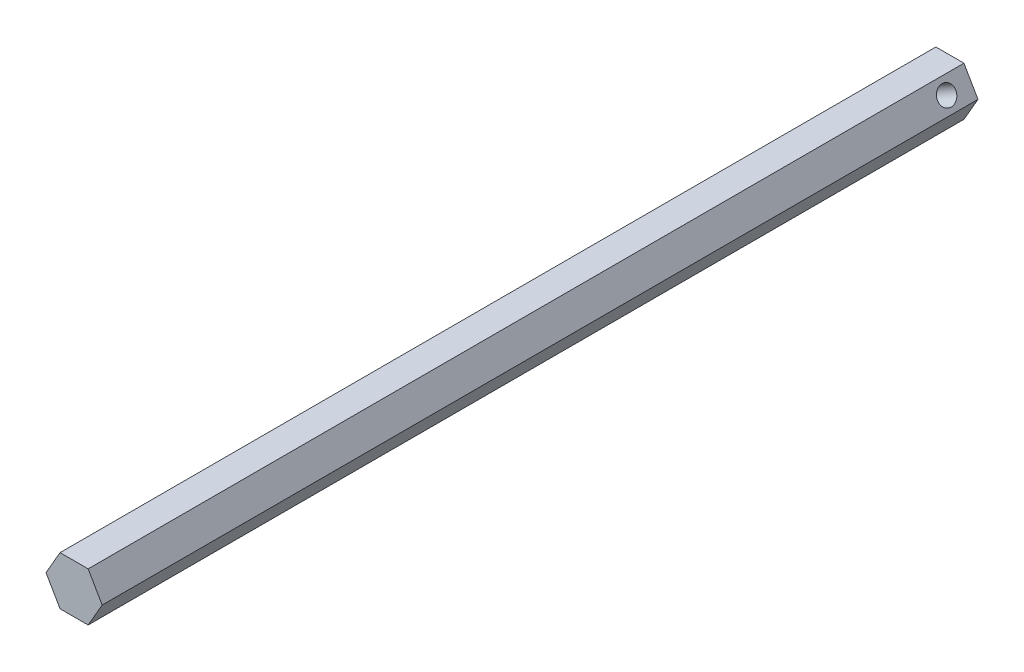
ISO-10303-21;
HEADER;
FILE_DESCRIPTION(('STEP AP214'),'2;1');
FILE_NAME('part.step','',(''),(''),'','','');
FILE_SCHEMA(('AUTOMOTIVE_DESIGN { 1 0 10303 214 1 1 1 1 }'));
ENDSEC;
DATA;
#1=APPLICATION_CONTEXT('core data for automotive mechanical design processes');
#2=APPLICATION_PROTOCOL_DEFINITION('international standard','automotive_design',2000,#1);
#3=PRODUCT_CONTEXT('',#1,'mechanical');
#4=PRODUCT('Part','Part','',(#3));
#5=PRODUCT_RELATED_PRODUCT_CATEGORY('part','',(#4));
#6=PRODUCT_DEFINITION_FORMATION('','',#4);
#7=PRODUCT_DEFINITION_CONTEXT('part definition',#1,'design');
#8=PRODUCT_DEFINITION('design','',#6,#7);
#9=PRODUCT_DEFINITION_SHAPE('','',#8);
#10=(LENGTH_UNIT() NAMED_UNIT(*) SI_UNIT(.MILLI.,.METRE.));
#11=(NAMED_UNIT(*) PLANE_ANGLE_UNIT() SI_UNIT($,.RADIAN.));
#12=(NAMED_UNIT(*) SI_UNIT($,.STERADIAN.) SOLID_ANGLE_UNIT());
#13=UNCERTAINTY_MEASURE_WITH_UNIT(LENGTH_MEASURE(1.E-05),#10,'distance_accuracy_value','');
#14=(GEOMETRIC_REPRESENTATION_CONTEXT(3) GLOBAL_UNCERTAINTY_ASSIGNED_CONTEXT((#13)) GLOBAL_UNIT_ASSIGNED_CONTEXT((#10,
#11,#12)) REPRESENTATION_CONTEXT('',''));
#15=CARTESIAN_POINT('',(0.,0.,0.));
#16=DIRECTION('',(0.,0.,1.));
#17=DIRECTION('',(1.,0.,0.));
#18=AXIS2_PLACEMENT_3D('',#15,#16,#17);
#19=CARTESIAN_POINT('',(-7.33234841870825,0.,228.6));
#20=DIRECTION('',(0.866025403784438,0.5,0.));
#21=DIRECTION('',(-0.5,0.866025403784439,0.));
#22=AXIS2_PLACEMENT_3D('',#19,#20,#21);
#23=PLANE('',#22);
#24=CARTESIAN_POINT('',(-5.49926131403118,-3.175,6.35));
#25=DIRECTION('',(0.866025403784438,0.5,0.));
#26=DIRECTION('',(-0.5,0.866025403784439,0.));
#27=AXIS2_PLACEMENT_3D('',#24,#25,#26);
#28=CIRCLE('',#27,2.38125);
#29=CARTESIAN_POINT('',(-6.68988631403119,-1.11277700723831,6.35));
#30=VERTEX_POINT('',#29);
#31=EDGE_CURVE('E139',#30,#30,#28,.T.);
#32=ORIENTED_EDGE('',*,*,#31,.T.);
#33=EDGE_LOOP('',(#32));
#34=FACE_BOUND('',#33,.T.);
#35=DIRECTION('',(0.5,-0.866025403784439,0.));
#36=VECTOR('',#35,1.);
#37=CARTESIAN_POINT('',(-7.33234841870825,0.,0.));
#38=LINE('',#37,#36);
#39=CARTESIAN_POINT('',(-7.33234841870825,0.,0.));
#40=VERTEX_POINT('',#39);
#41=CARTESIAN_POINT('',(-3.66617420935412,-6.35,0.));
#42=VERTEX_POINT('',#41);
#43=EDGE_CURVE('E134',#40,#42,#38,.T.);
#44=ORIENTED_EDGE('',*,*,#43,.T.);
#45=DIRECTION('',(0.,0.,-1.));
#46=VECTOR('',#45,1.);
#47=CARTESIAN_POINT('',(-3.66617420935412,-6.35,228.6));
#48=LINE('',#47,#46);
#49=CARTESIAN_POINT('',(-3.66617420935412,-6.35,228.6));
#50=VERTEX_POINT('',#49);
#51=EDGE_CURVE('E11',#50,#42,#48,.T.);
#52=ORIENTED_EDGE('',*,*,#51,.F.);
#53=DIRECTION('',(0.5,-0.866025403784439,0.));
#54=VECTOR('',#53,1.);
#55=CARTESIAN_POINT('',(-7.33234841870825,0.,228.6));
#56=LINE('',#55,#54);
#57=CARTESIAN_POINT('',(-7.33234841870825,0.,228.6));
#58=VERTEX_POINT('',#57);
#59=EDGE_CURVE('E151',#58,#50,#56,.T.);
#60=ORIENTED_EDGE('',*,*,#59,.F.);
#61=DIRECTION('',(0.,0.,-1.));
#62=VECTOR('',#61,1.);
#63=CARTESIAN_POINT('',(-7.33234841870825,0.,228.6));
#64=LINE('',#63,#62);
#65=EDGE_CURVE('E130',#58,#40,#64,.T.);
#66=ORIENTED_EDGE('',*,*,#65,.T.);
#67=EDGE_LOOP('',(#44,#52,#60,#66));
#68=FACE_BOUND('',#67,.T.);
#69=ADVANCED_FACE('F45',(#34,#68),#23,.F.);
#70=CARTESIAN_POINT('',(-3.66617420935412,-6.35,228.6));
#71=DIRECTION('',(0.,1.,0.));
#72=DIRECTION('',(0.,0.,1.));
#73=AXIS2_PLACEMENT_3D('',#70,#71,#72);
#74=PLANE('',#73);
#75=DIRECTION('',(1.,0.,0.));
#76=VECTOR('',#75,1.);
#77=CARTESIAN_POINT('',(-3.66617420935412,-6.35,0.));
#78=LINE('',#77,#76);
#79=CARTESIAN_POINT('',(3.66617420935412,-6.35,0.));
#80=VERTEX_POINT('',#79);
#81=EDGE_CURVE('E138',#42,#80,#78,.T.);
#82=ORIENTED_EDGE('',*,*,#81,.T.);
#83=DIRECTION('',(0.,0.,-1.));
#84=VECTOR('',#83,1.);
#85=CARTESIAN_POINT('',(3.66617420935412,-6.35,228.6));
#86=LINE('',#85,#84);
#87=CARTESIAN_POINT('',(3.66617420935412,-6.35,228.6));
#88=VERTEX_POINT('',#87);
#89=EDGE_CURVE('E54',#88,#80,#86,.T.);
#90=ORIENTED_EDGE('',*,*,#89,.F.);
#91=DIRECTION('',(1.,0.,0.));
#92=VECTOR('',#91,1.);
#93=CARTESIAN_POINT('',(-3.66617420935412,-6.35,228.6));
#94=LINE('',#93,#92);
#95=EDGE_CURVE('E99',#50,#88,#94,.T.);
#96=ORIENTED_EDGE('',*,*,#95,.F.);
#97=ORIENTED_EDGE('',*,*,#51,.T.);
#98=EDGE_LOOP('',(#82,#90,#96,#97));
#99=FACE_BOUND('',#98,.T.);
#100=ADVANCED_FACE('F179',(#99),#74,.F.);
#101=CARTESIAN_POINT('',(3.66617420935412,-6.35,228.6));
#102=DIRECTION('',(-0.866025403784438,0.5,0.));
#103=DIRECTION('',(-0.5,-0.866025403784439,0.));
#104=AXIS2_PLACEMENT_3D('',#101,#102,#103);
#105=PLANE('',#104);
#106=DIRECTION('',(0.5,0.866025403784438,0.));
#107=VECTOR('',#106,1.);
#108=CARTESIAN_POINT('',(3.66617420935412,-6.35,0.));
#109=LINE('',#108,#107);
#110=CARTESIAN_POINT('',(7.33234841870825,0.,0.));
#111=VERTEX_POINT('',#110);
#112=EDGE_CURVE('E142',#80,#111,#109,.T.);
#113=ORIENTED_EDGE('',*,*,#112,.T.);
#114=DIRECTION('',(0.,0.,-1.));
#115=VECTOR('',#114,1.);
#116=CARTESIAN_POINT('',(7.33234841870825,0.,228.6));
#117=LINE('',#116,#115);
#118=CARTESIAN_POINT('',(7.33234841870825,0.,228.6));
#119=VERTEX_POINT('',#118);
#120=EDGE_CURVE('E123',#119,#111,#117,.T.);
#121=ORIENTED_EDGE('',*,*,#120,.F.);
#122=DIRECTION('',(0.5,0.866025403784438,0.));
#123=VECTOR('',#122,1.);
#124=CARTESIAN_POINT('',(3.66617420935412,-6.35,228.6));
#125=LINE('',#124,#123);
#126=EDGE_CURVE('E112',#88,#119,#125,.T.);
#127=ORIENTED_EDGE('',*,*,#126,.F.);
#128=ORIENTED_EDGE('',*,*,#89,.T.);
#129=EDGE_LOOP('',(#113,#121,#127,#128));
#130=FACE_BOUND('',#129,.T.);
#131=ADVANCED_FACE('F161',(#130),#105,.F.);
#132=CARTESIAN_POINT('',(7.33234841870825,0.,228.6));
#133=DIRECTION('',(-0.866025403784439,-0.5,0.));
#134=DIRECTION('',(0.5,-0.866025403784439,0.));
#135=AXIS2_PLACEMENT_3D('',#132,#133,#134);
#136=PLANE('',#135);
#137=CARTESIAN_POINT('',(5.49926131403119,3.175,6.35));
#138=DIRECTION('',(0.866025403784439,0.5,0.));
#139=DIRECTION('',(-0.5,0.866025403784439,0.));
#140=AXIS2_PLACEMENT_3D('',#137,#138,#139);
#141=CIRCLE('',#140,2.38125);
#142=CARTESIAN_POINT('',(4.30863631403119,5.2372229927617,6.35));
#143=VERTEX_POINT('',#142);
#144=EDGE_CURVE('E190',#143,#143,#141,.T.);
#145=ORIENTED_EDGE('',*,*,#144,.F.);
#146=EDGE_LOOP('',(#145));
#147=FACE_BOUND('',#146,.T.);
#148=DIRECTION('',(-0.5,0.866025403784439,0.));
#149=VECTOR('',#148,1.);
#150=CARTESIAN_POINT('',(7.33234841870825,0.,0.));
#151=LINE('',#150,#149);
#152=CARTESIAN_POINT('',(3.66617420935412,6.35,0.));
#153=VERTEX_POINT('',#152);
#154=EDGE_CURVE('E121',#111,#153,#151,.T.);
#155=ORIENTED_EDGE('',*,*,#154,.T.);
#156=DIRECTION('',(0.,0.,-1.));
#157=VECTOR('',#156,1.);
#158=CARTESIAN_POINT('',(3.66617420935412,6.35,228.6));
#159=LINE('',#158,#157);
#160=CARTESIAN_POINT('',(3.66617420935412,6.35,228.6));
#161=VERTEX_POINT('',#160);
#162=EDGE_CURVE('E118',#161,#153,#159,.T.);
#163=ORIENTED_EDGE('',*,*,#162,.F.);
#164=DIRECTION('',(-0.5,0.866025403784439,0.));
#165=VECTOR('',#164,1.);
#166=CARTESIAN_POINT('',(7.33234841870825,0.,228.6));
#167=LINE('',#166,#165);
#168=EDGE_CURVE('E106',#119,#161,#167,.T.);
#169=ORIENTED_EDGE('',*,*,#168,.F.);
#170=ORIENTED_EDGE('',*,*,#120,.T.);
#171=EDGE_LOOP('',(#155,#163,#169,#170));
#172=FACE_BOUND('',#171,.T.);
#173=ADVANCED_FACE('F119',(#147,#172),#136,.F.);
#174=CARTESIAN_POINT('',(3.66617420935412,6.35,228.6));
#175=DIRECTION('',(0.,-1.,0.));
#176=DIRECTION('',(0.,0.,-1.));
#177=AXIS2_PLACEMENT_3D('',#174,#175,#176);
#178=PLANE('',#177);
#179=DIRECTION('',(-1.,0.,0.));
#180=VECTOR('',#179,1.);
#181=CARTESIAN_POINT('',(3.66617420935412,6.35,0.));
#182=LINE('',#181,#180);
#183=CARTESIAN_POINT('',(-3.66617420935412,6.35,0.));
#184=VERTEX_POINT('',#183);
#185=EDGE_CURVE('E85',#153,#184,#182,.T.);
#186=ORIENTED_EDGE('',*,*,#185,.T.);
#187=DIRECTION('',(0.,0.,-1.));
#188=VECTOR('',#187,1.);
#189=CARTESIAN_POINT('',(-3.66617420935412,6.35,228.6));
#190=LINE('',#189,#188);
#191=CARTESIAN_POINT('',(-3.66617420935412,6.35,228.6));
#192=VERTEX_POINT('',#191);
#193=EDGE_CURVE('E124',#192,#184,#190,.T.);
#194=ORIENTED_EDGE('',*,*,#193,.F.);
#195=DIRECTION('',(-1.,0.,0.));
#196=VECTOR('',#195,1.);
#197=CARTESIAN_POINT('',(3.66617420935412,6.35,228.6));
#198=LINE('',#197,#196);
#199=EDGE_CURVE('E110',#161,#192,#198,.T.);
#200=ORIENTED_EDGE('',*,*,#199,.F.);
#201=ORIENTED_EDGE('',*,*,#162,.T.);
#202=EDGE_LOOP('',(#186,#194,#200,#201));
#203=FACE_BOUND('',#202,.T.);
#204=ADVANCED_FACE('F126',(#203),#178,.F.);
#205=CARTESIAN_POINT('',(-3.66617420935412,6.35,228.6));
#206=DIRECTION('',(0.866025403784438,-0.5,0.));
#207=DIRECTION('',(0.5,0.866025403784439,0.));
#208=AXIS2_PLACEMENT_3D('',#205,#206,#207);
#209=PLANE('',#208);
#210=DIRECTION('',(-0.5,-0.866025403784438,0.));
#211=VECTOR('',#210,1.);
#212=CARTESIAN_POINT('',(-3.66617420935412,6.35,0.));
#213=LINE('',#212,#211);
#214=EDGE_CURVE('E91',#184,#40,#213,.T.);
#215=ORIENTED_EDGE('',*,*,#214,.T.);
#216=ORIENTED_EDGE('',*,*,#65,.F.);
#217=DIRECTION('',(-0.5,-0.866025403784438,0.));
#218=VECTOR('',#217,1.);
#219=CARTESIAN_POINT('',(-3.66617420935412,6.35,228.6));
#220=LINE('',#219,#218);
#221=EDGE_CURVE('E62',#192,#58,#220,.T.);
#222=ORIENTED_EDGE('',*,*,#221,.F.);
#223=ORIENTED_EDGE('',*,*,#193,.T.);
#224=EDGE_LOOP('',(#215,#216,#222,#223));
#225=FACE_BOUND('',#224,.T.);
#226=ADVANCED_FACE('F168',(#225),#209,.F.);
#227=CARTESIAN_POINT('',(0.,0.,228.6));
#228=DIRECTION('',(0.,0.,1.));
#229=DIRECTION('',(1.,0.,0.));
#230=AXIS2_PLACEMENT_3D('',#227,#228,#229);
#231=PLANE('',#230);
#232=ORIENTED_EDGE('',*,*,#59,.T.);
#233=ORIENTED_EDGE('',*,*,#95,.T.);
#234=ORIENTED_EDGE('',*,*,#126,.T.);
#235=ORIENTED_EDGE('',*,*,#168,.T.);
#236=ORIENTED_EDGE('',*,*,#199,.T.);
#237=ORIENTED_EDGE('',*,*,#221,.T.);
#238=EDGE_LOOP('',(#232,#233,#234,#235,#236,#237));
#239=FACE_BOUND('',#238,.T.);
#240=ADVANCED_FACE('F108',(#239),#231,.T.);
#241=CARTESIAN_POINT('',(0.,0.,0.));
#242=DIRECTION('',(0.,0.,1.));
#243=DIRECTION('',(1.,0.,0.));
#244=AXIS2_PLACEMENT_3D('',#241,#242,#243);
#245=PLANE('',#244);
#246=ORIENTED_EDGE('',*,*,#43,.F.);
#247=ORIENTED_EDGE('',*,*,#214,.F.);
#248=ORIENTED_EDGE('',*,*,#185,.F.);
#249=ORIENTED_EDGE('',*,*,#154,.F.);
#250=ORIENTED_EDGE('',*,*,#112,.F.);
#251=ORIENTED_EDGE('',*,*,#81,.F.);
#252=EDGE_LOOP('',(#246,#247,#248,#249,#250,#251));
#253=FACE_BOUND('',#252,.T.);
#254=ADVANCED_FACE('F164',(#253),#245,.F.);
#255=CARTESIAN_POINT('',(-8.24889197104678,-4.7625,6.35));
#256=DIRECTION('',(0.866025403784439,0.5,0.));
#257=DIRECTION('',(-0.5,0.866025403784439,0.));
#258=AXIS2_PLACEMENT_3D('',#255,#256,#257);
#259=CYLINDRICAL_SURFACE('',#258,2.38125);
#260=ORIENTED_EDGE('',*,*,#144,.T.);
#261=EDGE_LOOP('',(#260));
#262=FACE_BOUND('',#261,.T.);
#263=ORIENTED_EDGE('',*,*,#31,.F.);
#264=EDGE_LOOP('',(#263));
#265=FACE_BOUND('',#264,.T.);
#266=ADVANCED_FACE('F202',(#262,#265),#259,.F.);
#267=CLOSED_SHELL('',(#69,#100,#131,#173,#204,#226,#240,#254,#266));
#268=MANIFOLD_SOLID_BREP('B2',#267);
#269=ADVANCED_BREP_SHAPE_REPRESENTATION('',(#18,#268),#14);
#270=SHAPE_DEFINITION_REPRESENTATION(#9,#269);
ENDSEC;
END-ISO-10303-21;
